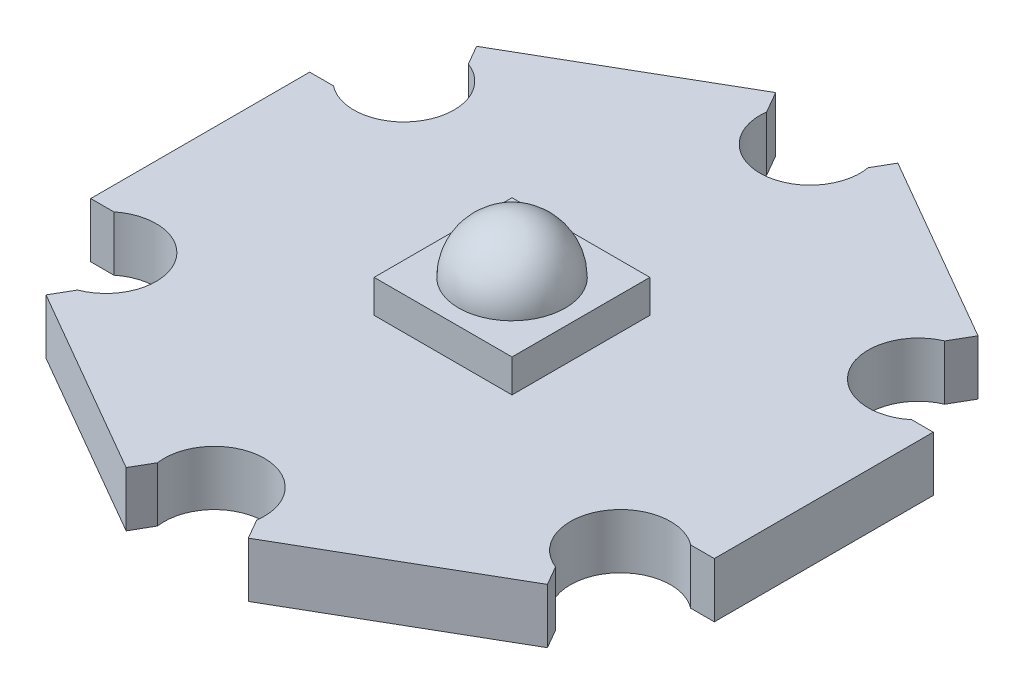
ISO-10303-21;
HEADER;
FILE_DESCRIPTION(('STEP AP214'),'2;1');
FILE_NAME('part.step','',(''),(''),'','','');
FILE_SCHEMA(('AUTOMOTIVE_DESIGN { 1 0 10303 214 1 1 1 1 }'));
ENDSEC;
DATA;
#1=APPLICATION_CONTEXT('core data for automotive mechanical design processes');
#2=APPLICATION_PROTOCOL_DEFINITION('international standard','automotive_design',2000,#1);
#3=PRODUCT_CONTEXT('',#1,'mechanical');
#4=PRODUCT('Part','Part','',(#3));
#5=PRODUCT_RELATED_PRODUCT_CATEGORY('part','',(#4));
#6=PRODUCT_DEFINITION_FORMATION('','',#4);
#7=PRODUCT_DEFINITION_CONTEXT('part definition',#1,'design');
#8=PRODUCT_DEFINITION('design','',#6,#7);
#9=PRODUCT_DEFINITION_SHAPE('','',#8);
#10=(LENGTH_UNIT() NAMED_UNIT(*) SI_UNIT(.MILLI.,.METRE.));
#11=(NAMED_UNIT(*) PLANE_ANGLE_UNIT() SI_UNIT($,.RADIAN.));
#12=(NAMED_UNIT(*) SI_UNIT($,.STERADIAN.) SOLID_ANGLE_UNIT());
#13=UNCERTAINTY_MEASURE_WITH_UNIT(LENGTH_MEASURE(1.E-05),#10,'distance_accuracy_value','');
#14=(GEOMETRIC_REPRESENTATION_CONTEXT(3) GLOBAL_UNCERTAINTY_ASSIGNED_CONTEXT((#13)) GLOBAL_UNIT_ASSIGNED_CONTEXT((#10,
#11,#12)) REPRESENTATION_CONTEXT('',''));
#15=CARTESIAN_POINT('',(0.,0.,0.));
#16=DIRECTION('',(0.,0.,1.));
#17=DIRECTION('',(1.,0.,0.));
#18=AXIS2_PLACEMENT_3D('',#15,#16,#17);
#19=CARTESIAN_POINT('',(0.,1.75,0.));
#20=DIRECTION('',(0.,1.,0.));
#21=DIRECTION('',(0.,0.,1.));
#22=AXIS2_PLACEMENT_3D('',#19,#20,#21);
#23=PLANE('',#22);
#24=CARTESIAN_POINT('',(-8.21347439932689,1.75,4.7420782115678));
#25=DIRECTION('',(0.,1.,0.));
#26=DIRECTION('',(0.,0.,1.));
#27=AXIS2_PLACEMENT_3D('',#24,#25,#26);
#28=CIRCLE('',#27,1.6);
#29=CARTESIAN_POINT('',(-7.63237899779938,1.75,6.23282572014314));
#30=VERTEX_POINT('',#29);
#31=CARTESIAN_POINT('',(-9.21390219566101,1.75,3.4934212433327));
#32=VERTEX_POINT('',#31);
#33=EDGE_CURVE('E258',#30,#32,#28,.T.);
#34=ORIENTED_EDGE('',*,*,#33,.F.);
#35=DIRECTION('',(-0.5,0.,0.866025403784439));
#36=VECTOR('',#35,1.);
#37=CARTESIAN_POINT('',(-3.02539154284704,1.75,-1.74671062166676));
#38=LINE('',#37,#36);
#39=CARTESIAN_POINT('',(-8.00039154284681,1.75,6.87024214598801));
#40=VERTEX_POINT('',#39);
#41=EDGE_CURVE('E297',#30,#40,#38,.T.);
#42=ORIENTED_EDGE('',*,*,#41,.T.);
#43=DIRECTION('',(0.866025403784439,0.,0.5));
#44=VECTOR('',#43,1.);
#45=CARTESIAN_POINT('',(-4.97499999999976,1.75,8.61695276765477));
#46=LINE('',#45,#44);
#47=CARTESIAN_POINT('',(-1.94960845715319,1.75,10.3636633893213));
#48=VERTEX_POINT('',#47);
#49=EDGE_CURVE('E292',#40,#48,#46,.T.);
#50=ORIENTED_EDGE('',*,*,#49,.T.);
#51=DIRECTION('',(0.499999999999999,0.,-0.866025403784439));
#52=VECTOR('',#51,1.);
#53=CARTESIAN_POINT('',(3.02539154284657,1.75,1.74671062166648));
#54=LINE('',#53,#52);
#55=CARTESIAN_POINT('',(-1.58345882645334,1.75,9.72947362577652));
#56=VERTEX_POINT('',#55);
#57=EDGE_CURVE('E305',#48,#56,#54,.T.);
#58=ORIENTED_EDGE('',*,*,#57,.T.);
#59=CARTESIAN_POINT('',(0.,1.75,9.5));
#60=DIRECTION('',(0.,1.,0.));
#61=DIRECTION('',(0.,0.,1.));
#62=AXIS2_PLACEMENT_3D('',#59,#60,#61);
#63=CIRCLE('',#62,1.6);
#64=CARTESIAN_POINT('',(1.58345882645334,1.75,9.72947362577651));
#65=VERTEX_POINT('',#64);
#66=EDGE_CURVE('E285',#65,#56,#63,.T.);
#67=ORIENTED_EDGE('',*,*,#66,.F.);
#68=DIRECTION('',(0.5,0.,0.866025403784439));
#69=VECTOR('',#68,1.);
#70=CARTESIAN_POINT('',(-3.02539154284657,1.75,1.74671062166649));
#71=LINE('',#70,#69);
#72=CARTESIAN_POINT('',(1.94960845715319,1.75,10.3636633893212));
#73=VERTEX_POINT('',#72);
#74=EDGE_CURVE('E339',#65,#73,#71,.T.);
#75=ORIENTED_EDGE('',*,*,#74,.T.);
#76=DIRECTION('',(0.866025403784439,0.,-0.5));
#77=VECTOR('',#76,1.);
#78=CARTESIAN_POINT('',(4.97499999999977,1.75,8.61695276765476));
#79=LINE('',#78,#77);
#80=CARTESIAN_POINT('',(8.00039154284681,1.75,6.870242145988));
#81=VERTEX_POINT('',#80);
#82=EDGE_CURVE('E333',#73,#81,#79,.T.);
#83=ORIENTED_EDGE('',*,*,#82,.T.);
#84=DIRECTION('',(-0.5,0.,-0.866025403784438));
#85=VECTOR('',#84,1.);
#86=CARTESIAN_POINT('',(3.02539154284704,1.75,-1.74671062166676));
#87=LINE('',#86,#85);
#88=CARTESIAN_POINT('',(7.64612293613772,1.75,6.25663091964122));
#89=VERTEX_POINT('',#88);
#90=EDGE_CURVE('E347',#81,#89,#87,.T.);
#91=ORIENTED_EDGE('',*,*,#90,.T.);
#92=CARTESIAN_POINT('',(8.22721833766523,1.75,4.76588341106587));
#93=DIRECTION('',(0.,1.,0.));
#94=DIRECTION('',(0.,0.,1.));
#95=AXIS2_PLACEMENT_3D('',#92,#93,#94);
#96=CIRCLE('',#95,1.6);
#97=CARTESIAN_POINT('',(9.19718742567154,1.75,3.4934212433327));
#98=VERTEX_POINT('',#97);
#99=EDGE_CURVE('E247',#98,#89,#96,.T.);
#100=ORIENTED_EDGE('',*,*,#99,.F.);
#101=DIRECTION('',(1.,0.,0.));
#102=VECTOR('',#101,1.);
#103=CARTESIAN_POINT('',(0.,1.75,3.4934212433327));
#104=LINE('',#103,#102);
#105=CARTESIAN_POINT('',(9.95,1.75,3.4934212433327));
#106=VERTEX_POINT('',#105);
#107=EDGE_CURVE('E318',#98,#106,#104,.T.);
#108=ORIENTED_EDGE('',*,*,#107,.T.);
#109=DIRECTION('',(0.,0.,-1.));
#110=VECTOR('',#109,1.);
#111=CARTESIAN_POINT('',(9.95,1.75,0.));
#112=LINE('',#111,#110);
#113=CARTESIAN_POINT('',(9.95,1.75,-3.49342124333378));
#114=VERTEX_POINT('',#113);
#115=EDGE_CURVE('E312',#106,#114,#112,.T.);
#116=ORIENTED_EDGE('',*,*,#115,.T.);
#117=DIRECTION('',(-1.,0.,0.));
#118=VECTOR('',#117,1.);
#119=CARTESIAN_POINT('',(0.,1.75,-3.49342124333378));
#120=LINE('',#119,#118);
#121=CARTESIAN_POINT('',(9.26094637796826,1.75,-3.49342124333378));
#122=VERTEX_POINT('',#121);
#123=EDGE_CURVE('E326',#114,#122,#120,.T.);
#124=ORIENTED_EDGE('',*,*,#123,.T.);
#125=CARTESIAN_POINT('',(8.24096227600355,1.75,-4.72615496630044));
#126=DIRECTION('',(0.,1.,0.));
#127=DIRECTION('',(0.,0.,1.));
#128=AXIS2_PLACEMENT_3D('',#125,#126,#127);
#129=CIRCLE('',#128,1.6);
#130=CARTESIAN_POINT('',(7.61186116589056,1.75,-6.197287792817));
#131=VERTEX_POINT('',#130);
#132=EDGE_CURVE('E272',#131,#122,#129,.T.);
#133=ORIENTED_EDGE('',*,*,#132,.F.);
#134=DIRECTION('',(0.499999999999999,0.,-0.866025403784439));
#135=VECTOR('',#134,1.);
#136=CARTESIAN_POINT('',(3.02539154284657,1.75,1.74671062166648));
#137=LINE('',#136,#135);
#138=CARTESIAN_POINT('',(8.0003915428468,1.75,-6.87024214598909));
#139=VERTEX_POINT('',#138);
#140=EDGE_CURVE('E354',#131,#139,#137,.T.);
#141=ORIENTED_EDGE('',*,*,#140,.T.);
#142=DIRECTION('',(0.866025403784439,0.,0.5));
#143=VECTOR('',#142,1.);
#144=CARTESIAN_POINT('',(4.97500000000023,1.75,-8.61695276765557));
#145=LINE('',#144,#143);
#146=CARTESIAN_POINT('',(1.94960845715319,1.75,-10.3636633893223));
#147=VERTEX_POINT('',#146);
#148=EDGE_CURVE('E367',#147,#139,#145,.T.);
#149=ORIENTED_EDGE('',*,*,#148,.F.);
#150=DIRECTION('',(-0.5,0.,0.866025403784439));
#151=VECTOR('',#150,1.);
#152=CARTESIAN_POINT('',(-3.02539154284704,1.75,-1.74671062166676));
#153=LINE('',#152,#151);
#154=CARTESIAN_POINT('',(1.60294774285476,1.75,-9.76322941916932));
#155=VERTEX_POINT('',#154);
#156=EDGE_CURVE('E359',#147,#155,#153,.T.);
#157=ORIENTED_EDGE('',*,*,#156,.T.);
#158=CARTESIAN_POINT('',(0.0274878766766615,1.75,-9.48407675473264));
#159=DIRECTION('',(0.,1.,0.));
#160=DIRECTION('',(0.,0.,1.));
#161=AXIS2_PLACEMENT_3D('',#158,#159,#160);
#162=CIRCLE('',#161,1.6);
#163=CARTESIAN_POINT('',(-1.55947285981209,1.75,-9.68792871288629));
#164=VERTEX_POINT('',#163);
#165=EDGE_CURVE('E267',#164,#155,#162,.T.);
#166=ORIENTED_EDGE('',*,*,#165,.F.);
#167=DIRECTION('',(-0.5,0.,-0.866025403784438));
#168=VECTOR('',#167,1.);
#169=CARTESIAN_POINT('',(3.02539154284704,1.75,-1.74671062166676));
#170=LINE('',#169,#168);
#171=CARTESIAN_POINT('',(-1.9496084571532,1.75,-10.3636633893223));
#172=VERTEX_POINT('',#171);
#173=EDGE_CURVE('E374',#164,#172,#170,.T.);
#174=ORIENTED_EDGE('',*,*,#173,.T.);
#175=DIRECTION('',(0.866025403784439,0.,-0.5));
#176=VECTOR('',#175,1.);
#177=CARTESIAN_POINT('',(-4.97500000000023,1.75,-8.61695276765557));
#178=LINE('',#177,#176);
#179=CARTESIAN_POINT('',(-8.0003915428468,1.75,-6.87024214598908));
#180=VERTEX_POINT('',#179);
#181=EDGE_CURVE('E388',#180,#172,#178,.T.);
#182=ORIENTED_EDGE('',*,*,#181,.F.);
#183=DIRECTION('',(0.5,0.,0.866025403784439));
#184=VECTOR('',#183,1.);
#185=CARTESIAN_POINT('',(-3.02539154284657,1.75,1.74671062166649));
#186=LINE('',#185,#184);
#187=CARTESIAN_POINT('',(-7.64208522195565,1.75,-6.24963739353252));
#188=VERTEX_POINT('',#187);
#189=EDGE_CURVE('E380',#180,#188,#186,.T.);
#190=ORIENTED_EDGE('',*,*,#189,.T.);
#191=CARTESIAN_POINT('',(-8.19973046098856,1.75,-4.74996016579852));
#192=DIRECTION('',(0.,1.,0.));
#193=DIRECTION('',(0.,0.,1.));
#194=AXIS2_PLACEMENT_3D('',#191,#192,#193);
#195=CIRCLE('',#194,1.6);
#196=CARTESIAN_POINT('',(-9.19024039851122,1.75,-3.49342124333378));
#197=VERTEX_POINT('',#196);
#198=EDGE_CURVE('E60',#197,#188,#195,.T.);
#199=ORIENTED_EDGE('',*,*,#198,.F.);
#200=DIRECTION('',(-1.,0.,0.));
#201=VECTOR('',#200,1.);
#202=CARTESIAN_POINT('',(0.,1.75,-3.49342124333378));
#203=LINE('',#202,#201);
#204=CARTESIAN_POINT('',(-9.95,1.75,-3.49342124333378));
#205=VERTEX_POINT('',#204);
#206=EDGE_CURVE('E395',#197,#205,#203,.T.);
#207=ORIENTED_EDGE('',*,*,#206,.T.);
#208=DIRECTION('',(0.,0.,-1.));
#209=VECTOR('',#208,1.);
#210=CARTESIAN_POINT('',(-9.95,1.75,0.));
#211=LINE('',#210,#209);
#212=CARTESIAN_POINT('',(-9.95,1.75,3.4934212433327));
#213=VERTEX_POINT('',#212);
#214=EDGE_CURVE('E409',#213,#205,#211,.T.);
#215=ORIENTED_EDGE('',*,*,#214,.F.);
#216=DIRECTION('',(1.,0.,0.));
#217=VECTOR('',#216,1.);
#218=CARTESIAN_POINT('',(0.,1.75,3.4934212433327));
#219=LINE('',#218,#217);
#220=EDGE_CURVE('E401',#213,#32,#219,.T.);
#221=ORIENTED_EDGE('',*,*,#220,.T.);
#222=EDGE_LOOP('',(#34,#42,#50,#58,#67,#75,#83,#91,#100,#108,#116,#124,#133,#141,#149,#157,#166,
#174,#182,#190,#199,#207,#215,#221));
#223=FACE_BOUND('',#222,.T.);
#224=DIRECTION('',(1.,0.,0.));
#225=VECTOR('',#224,1.);
#226=CARTESIAN_POINT('',(-2.2,1.75,2.2));
#227=LINE('',#226,#225);
#228=CARTESIAN_POINT('',(-2.2,1.75,2.2));
#229=VERTEX_POINT('',#228);
#230=CARTESIAN_POINT('',(2.2,1.75,2.2));
#231=VERTEX_POINT('',#230);
#232=EDGE_CURVE('E803',#229,#231,#227,.T.);
#233=ORIENTED_EDGE('',*,*,#232,.F.);
#234=DIRECTION('',(0.,0.,1.));
#235=VECTOR('',#234,1.);
#236=CARTESIAN_POINT('',(-2.2,1.75,-2.2));
#237=LINE('',#236,#235);
#238=CARTESIAN_POINT('',(-2.2,1.75,-2.2));
#239=VERTEX_POINT('',#238);
#240=EDGE_CURVE('E245',#239,#229,#237,.T.);
#241=ORIENTED_EDGE('',*,*,#240,.F.);
#242=DIRECTION('',(-1.,0.,0.));
#243=VECTOR('',#242,1.);
#244=CARTESIAN_POINT('',(-2.2,1.75,-2.2));
#245=LINE('',#244,#243);
#246=CARTESIAN_POINT('',(2.2,1.75,-2.2));
#247=VERTEX_POINT('',#246);
#248=EDGE_CURVE('E241',#247,#239,#245,.T.);
#249=ORIENTED_EDGE('',*,*,#248,.F.);
#250=DIRECTION('',(0.,0.,-1.));
#251=VECTOR('',#250,1.);
#252=CARTESIAN_POINT('',(2.2,1.75,-2.2));
#253=LINE('',#252,#251);
#254=EDGE_CURVE('E810',#231,#247,#253,.T.);
#255=ORIENTED_EDGE('',*,*,#254,.F.);
#256=EDGE_LOOP('',(#233,#241,#249,#255));
#257=FACE_BOUND('',#256,.T.);
#258=ADVANCED_FACE('F38',(#223,#257),#23,.T.);
#259=CARTESIAN_POINT('',(0.,0.,0.));
#260=DIRECTION('',(0.,1.,0.));
#261=DIRECTION('',(0.,0.,1.));
#262=AXIS2_PLACEMENT_3D('',#259,#260,#261);
#263=PLANE('',#262);
#264=DIRECTION('',(-0.5,0.,0.866025403784439));
#265=VECTOR('',#264,1.);
#266=CARTESIAN_POINT('',(-3.02539154284704,0.,-1.74671062166676));
#267=LINE('',#266,#265);
#268=CARTESIAN_POINT('',(-7.63237899779939,0.,6.23282572014314));
#269=VERTEX_POINT('',#268);
#270=CARTESIAN_POINT('',(-8.00039154284681,0.,6.87024214598801));
#271=VERTEX_POINT('',#270);
#272=EDGE_CURVE('E300',#269,#271,#267,.T.);
#273=ORIENTED_EDGE('',*,*,#272,.F.);
#274=CARTESIAN_POINT('',(-8.21347439932689,0.,4.7420782115678));
#275=DIRECTION('',(0.,1.,0.));
#276=DIRECTION('',(0.,0.,1.));
#277=AXIS2_PLACEMENT_3D('',#274,#275,#276);
#278=CIRCLE('',#277,1.6);
#279=CARTESIAN_POINT('',(-9.21390219566101,0.,3.4934212433327));
#280=VERTEX_POINT('',#279);
#281=EDGE_CURVE('E254',#269,#280,#278,.T.);
#282=ORIENTED_EDGE('',*,*,#281,.T.);
#283=DIRECTION('',(1.,0.,0.));
#284=VECTOR('',#283,1.);
#285=CARTESIAN_POINT('',(0.,0.,3.4934212433327));
#286=LINE('',#285,#284);
#287=CARTESIAN_POINT('',(-9.95,0.,3.4934212433327));
#288=VERTEX_POINT('',#287);
#289=EDGE_CURVE('E404',#288,#280,#286,.T.);
#290=ORIENTED_EDGE('',*,*,#289,.F.);
#291=DIRECTION('',(0.,0.,-1.));
#292=VECTOR('',#291,1.);
#293=CARTESIAN_POINT('',(-9.95,0.,0.));
#294=LINE('',#293,#292);
#295=CARTESIAN_POINT('',(-9.95,0.,-3.49342124333378));
#296=VERTEX_POINT('',#295);
#297=EDGE_CURVE('E400',#288,#296,#294,.T.);
#298=ORIENTED_EDGE('',*,*,#297,.T.);
#299=DIRECTION('',(-1.,0.,0.));
#300=VECTOR('',#299,1.);
#301=CARTESIAN_POINT('',(0.,0.,-3.49342124333378));
#302=LINE('',#301,#300);
#303=CARTESIAN_POINT('',(-9.19024039851122,0.,-3.49342124333378));
#304=VERTEX_POINT('',#303);
#305=EDGE_CURVE('E398',#304,#296,#302,.T.);
#306=ORIENTED_EDGE('',*,*,#305,.F.);
#307=CARTESIAN_POINT('',(-8.19973046098856,0.,-4.74996016579852));
#308=DIRECTION('',(0.,1.,0.));
#309=DIRECTION('',(0.,0.,1.));
#310=AXIS2_PLACEMENT_3D('',#307,#308,#309);
#311=CIRCLE('',#310,1.6);
#312=CARTESIAN_POINT('',(-7.64208522195565,0.,-6.24963739353252));
#313=VERTEX_POINT('',#312);
#314=EDGE_CURVE('E260',#304,#313,#311,.T.);
#315=ORIENTED_EDGE('',*,*,#314,.T.);
#316=DIRECTION('',(0.5,0.,0.866025403784439));
#317=VECTOR('',#316,1.);
#318=CARTESIAN_POINT('',(-3.02539154284657,0.,1.74671062166649));
#319=LINE('',#318,#317);
#320=CARTESIAN_POINT('',(-8.0003915428468,0.,-6.87024214598908));
#321=VERTEX_POINT('',#320);
#322=EDGE_CURVE('E383',#321,#313,#319,.T.);
#323=ORIENTED_EDGE('',*,*,#322,.F.);
#324=DIRECTION('',(0.866025403784439,0.,-0.5));
#325=VECTOR('',#324,1.);
#326=CARTESIAN_POINT('',(-4.97500000000023,0.,-8.61695276765557));
#327=LINE('',#326,#325);
#328=CARTESIAN_POINT('',(-1.9496084571532,0.,-10.3636633893223));
#329=VERTEX_POINT('',#328);
#330=EDGE_CURVE('E379',#321,#329,#327,.T.);
#331=ORIENTED_EDGE('',*,*,#330,.T.);
#332=DIRECTION('',(-0.5,0.,-0.866025403784438));
#333=VECTOR('',#332,1.);
#334=CARTESIAN_POINT('',(3.02539154284704,0.,-1.74671062166676));
#335=LINE('',#334,#333);
#336=CARTESIAN_POINT('',(-1.55947285981209,0.,-9.68792871288629));
#337=VERTEX_POINT('',#336);
#338=EDGE_CURVE('E377',#337,#329,#335,.T.);
#339=ORIENTED_EDGE('',*,*,#338,.F.);
#340=CARTESIAN_POINT('',(0.0274878766766615,0.,-9.48407675473264));
#341=DIRECTION('',(0.,1.,0.));
#342=DIRECTION('',(0.,0.,1.));
#343=AXIS2_PLACEMENT_3D('',#340,#341,#342);
#344=CIRCLE('',#343,1.6);
#345=CARTESIAN_POINT('',(1.60294774285476,0.,-9.76322941916932));
#346=VERTEX_POINT('',#345);
#347=EDGE_CURVE('E264',#337,#346,#344,.T.);
#348=ORIENTED_EDGE('',*,*,#347,.T.);
#349=DIRECTION('',(-0.5,0.,0.866025403784439));
#350=VECTOR('',#349,1.);
#351=CARTESIAN_POINT('',(-3.02539154284704,0.,-1.74671062166676));
#352=LINE('',#351,#350);
#353=CARTESIAN_POINT('',(1.94960845715319,0.,-10.3636633893223));
#354=VERTEX_POINT('',#353);
#355=EDGE_CURVE('E362',#354,#346,#352,.T.);
#356=ORIENTED_EDGE('',*,*,#355,.F.);
#357=DIRECTION('',(0.866025403784439,0.,0.5));
#358=VECTOR('',#357,1.);
#359=CARTESIAN_POINT('',(4.97500000000023,0.,-8.61695276765557));
#360=LINE('',#359,#358);
#361=CARTESIAN_POINT('',(8.0003915428468,0.,-6.87024214598909));
#362=VERTEX_POINT('',#361);
#363=EDGE_CURVE('E358',#354,#362,#360,.T.);
#364=ORIENTED_EDGE('',*,*,#363,.T.);
#365=DIRECTION('',(0.499999999999999,0.,-0.866025403784439));
#366=VECTOR('',#365,1.);
#367=CARTESIAN_POINT('',(3.02539154284657,0.,1.74671062166648));
#368=LINE('',#367,#366);
#369=CARTESIAN_POINT('',(7.61186116589056,0.,-6.197287792817));
#370=VERTEX_POINT('',#369);
#371=EDGE_CURVE('E356',#370,#362,#368,.T.);
#372=ORIENTED_EDGE('',*,*,#371,.F.);
#373=CARTESIAN_POINT('',(8.24096227600355,0.,-4.72615496630044));
#374=DIRECTION('',(0.,1.,0.));
#375=DIRECTION('',(0.,0.,1.));
#376=AXIS2_PLACEMENT_3D('',#373,#374,#375);
#377=CIRCLE('',#376,1.6);
#378=CARTESIAN_POINT('',(9.26094637796826,0.,-3.49342124333378));
#379=VERTEX_POINT('',#378);
#380=EDGE_CURVE('E269',#370,#379,#377,.T.);
#381=ORIENTED_EDGE('',*,*,#380,.T.);
#382=DIRECTION('',(-1.,0.,0.));
#383=VECTOR('',#382,1.);
#384=CARTESIAN_POINT('',(0.,0.,-3.49342124333378));
#385=LINE('',#384,#383);
#386=CARTESIAN_POINT('',(9.95,0.,-3.49342124333378));
#387=VERTEX_POINT('',#386);
#388=EDGE_CURVE('E317',#387,#379,#385,.T.);
#389=ORIENTED_EDGE('',*,*,#388,.F.);
#390=DIRECTION('',(0.,0.,-1.));
#391=VECTOR('',#390,1.);
#392=CARTESIAN_POINT('',(9.95,0.,0.));
#393=LINE('',#392,#391);
#394=CARTESIAN_POINT('',(9.95,0.,3.4934212433327));
#395=VERTEX_POINT('',#394);
#396=EDGE_CURVE('E314',#395,#387,#393,.T.);
#397=ORIENTED_EDGE('',*,*,#396,.F.);
#398=DIRECTION('',(1.,0.,0.));
#399=VECTOR('',#398,1.);
#400=CARTESIAN_POINT('',(0.,0.,3.4934212433327));
#401=LINE('',#400,#399);
#402=CARTESIAN_POINT('',(9.19718742567154,0.,3.4934212433327));
#403=VERTEX_POINT('',#402);
#404=EDGE_CURVE('E321',#403,#395,#401,.T.);
#405=ORIENTED_EDGE('',*,*,#404,.F.);
#406=CARTESIAN_POINT('',(8.22721833766523,0.,4.76588341106587));
#407=DIRECTION('',(0.,1.,0.));
#408=DIRECTION('',(0.,0.,1.));
#409=AXIS2_PLACEMENT_3D('',#406,#407,#408);
#410=CIRCLE('',#409,1.6);
#411=CARTESIAN_POINT('',(7.64612293613772,0.,6.25663091964122));
#412=VERTEX_POINT('',#411);
#413=EDGE_CURVE('E249',#403,#412,#410,.T.);
#414=ORIENTED_EDGE('',*,*,#413,.T.);
#415=DIRECTION('',(-0.5,0.,-0.866025403784438));
#416=VECTOR('',#415,1.);
#417=CARTESIAN_POINT('',(3.02539154284704,0.,-1.74671062166676));
#418=LINE('',#417,#416);
#419=CARTESIAN_POINT('',(8.00039154284681,0.,6.870242145988));
#420=VERTEX_POINT('',#419);
#421=EDGE_CURVE('E338',#420,#412,#418,.T.);
#422=ORIENTED_EDGE('',*,*,#421,.F.);
#423=DIRECTION('',(0.866025403784439,0.,-0.5));
#424=VECTOR('',#423,1.);
#425=CARTESIAN_POINT('',(4.97499999999977,0.,8.61695276765476));
#426=LINE('',#425,#424);
#427=CARTESIAN_POINT('',(1.94960845715319,0.,10.3636633893212));
#428=VERTEX_POINT('',#427);
#429=EDGE_CURVE('E335',#428,#420,#426,.T.);
#430=ORIENTED_EDGE('',*,*,#429,.F.);
#431=DIRECTION('',(0.5,0.,0.866025403784439));
#432=VECTOR('',#431,1.);
#433=CARTESIAN_POINT('',(-3.02539154284657,0.,1.74671062166649));
#434=LINE('',#433,#432);
#435=CARTESIAN_POINT('',(1.58345882645334,0.,9.72947362577651));
#436=VERTEX_POINT('',#435);
#437=EDGE_CURVE('E342',#436,#428,#434,.T.);
#438=ORIENTED_EDGE('',*,*,#437,.F.);
#439=CARTESIAN_POINT('',(0.,0.,9.5));
#440=DIRECTION('',(0.,1.,0.));
#441=DIRECTION('',(0.,0.,1.));
#442=AXIS2_PLACEMENT_3D('',#439,#440,#441);
#443=CIRCLE('',#442,1.6);
#444=CARTESIAN_POINT('',(-1.58345882645334,0.,9.72947362577652));
#445=VERTEX_POINT('',#444);
#446=EDGE_CURVE('E286',#436,#445,#443,.T.);
#447=ORIENTED_EDGE('',*,*,#446,.T.);
#448=DIRECTION('',(0.499999999999999,0.,-0.866025403784439));
#449=VECTOR('',#448,1.);
#450=CARTESIAN_POINT('',(3.02539154284657,0.,1.74671062166648));
#451=LINE('',#450,#449);
#452=CARTESIAN_POINT('',(-1.94960845715319,0.,10.3636633893213));
#453=VERTEX_POINT('',#452);
#454=EDGE_CURVE('E296',#453,#445,#451,.T.);
#455=ORIENTED_EDGE('',*,*,#454,.F.);
#456=DIRECTION('',(0.866025403784439,0.,0.5));
#457=VECTOR('',#456,1.);
#458=CARTESIAN_POINT('',(-4.97499999999976,0.,8.61695276765477));
#459=LINE('',#458,#457);
#460=EDGE_CURVE('E293',#271,#453,#459,.T.);
#461=ORIENTED_EDGE('',*,*,#460,.F.);
#462=EDGE_LOOP('',(#273,#282,#290,#298,#306,#315,#323,#331,#339,#348,#356,#364,#372,#381,#389,
#397,#405,#414,#422,#430,#438,#447,#455,#461));
#463=FACE_BOUND('',#462,.T.);
#464=ADVANCED_FACE('F436',(#463),#263,.F.);
#465=CARTESIAN_POINT('',(0.,0.,3.4934212433327));
#466=DIRECTION('',(0.,0.,1.));
#467=DIRECTION('',(1.,0.,0.));
#468=AXIS2_PLACEMENT_3D('',#465,#466,#467);
#469=PLANE('',#468);
#470=DIRECTION('',(0.,1.,0.));
#471=VECTOR('',#470,1.);
#472=CARTESIAN_POINT('',(-9.21390219566101,0.,3.4934212433327));
#473=LINE('',#472,#471);
#474=EDGE_CURVE('E257',#32,#280,#473,.F.);
#475=ORIENTED_EDGE('',*,*,#474,.F.);
#476=ORIENTED_EDGE('',*,*,#220,.F.);
#477=DIRECTION('',(0.,1.,0.));
#478=VECTOR('',#477,1.);
#479=CARTESIAN_POINT('',(-9.95,0.,3.4934212433327));
#480=LINE('',#479,#478);
#481=EDGE_CURVE('E414',#288,#213,#480,.T.);
#482=ORIENTED_EDGE('',*,*,#481,.F.);
#483=ORIENTED_EDGE('',*,*,#289,.T.);
#484=EDGE_LOOP('',(#475,#476,#482,#483));
#485=FACE_BOUND('',#484,.T.);
#486=ADVANCED_FACE('F506',(#485),#469,.T.);
#487=CARTESIAN_POINT('',(-9.95,0.,0.));
#488=DIRECTION('',(1.,0.,0.));
#489=DIRECTION('',(0.,0.,-1.));
#490=AXIS2_PLACEMENT_3D('',#487,#488,#489);
#491=PLANE('',#490);
#492=ORIENTED_EDGE('',*,*,#214,.T.);
#493=DIRECTION('',(0.,1.,0.));
#494=VECTOR('',#493,1.);
#495=CARTESIAN_POINT('',(-9.95,0.,-3.49342124333378));
#496=LINE('',#495,#494);
#497=EDGE_CURVE('E407',#296,#205,#496,.T.);
#498=ORIENTED_EDGE('',*,*,#497,.F.);
#499=ORIENTED_EDGE('',*,*,#297,.F.);
#500=ORIENTED_EDGE('',*,*,#481,.T.);
#501=EDGE_LOOP('',(#492,#498,#499,#500));
#502=FACE_BOUND('',#501,.T.);
#503=ADVANCED_FACE('F512',(#502),#491,.F.);
#504=CARTESIAN_POINT('',(0.,0.,-3.49342124333378));
#505=DIRECTION('',(0.,0.,-1.));
#506=DIRECTION('',(-1.,0.,0.));
#507=AXIS2_PLACEMENT_3D('',#504,#505,#506);
#508=PLANE('',#507);
#509=DIRECTION('',(0.,1.,0.));
#510=VECTOR('',#509,1.);
#511=CARTESIAN_POINT('',(-9.19024039851122,0.,-3.49342124333378));
#512=LINE('',#511,#510);
#513=EDGE_CURVE('E283',#304,#197,#512,.T.);
#514=ORIENTED_EDGE('',*,*,#513,.F.);
#515=ORIENTED_EDGE('',*,*,#305,.T.);
#516=ORIENTED_EDGE('',*,*,#497,.T.);
#517=ORIENTED_EDGE('',*,*,#206,.F.);
#518=EDGE_LOOP('',(#514,#515,#516,#517));
#519=FACE_BOUND('',#518,.T.);
#520=ADVANCED_FACE('F517',(#519),#508,.T.);
#521=CARTESIAN_POINT('',(-3.02539154284657,0.,1.74671062166649));
#522=DIRECTION('',(-0.866025403784439,0.,0.5));
#523=DIRECTION('',(0.5,0.,0.866025403784439));
#524=AXIS2_PLACEMENT_3D('',#521,#522,#523);
#525=PLANE('',#524);
#526=DIRECTION('',(0.,1.,0.));
#527=VECTOR('',#526,1.);
#528=CARTESIAN_POINT('',(-7.64208522195565,0.,-6.24963739353252));
#529=LINE('',#528,#527);
#530=EDGE_CURVE('E12',#188,#313,#529,.F.);
#531=ORIENTED_EDGE('',*,*,#530,.F.);
#532=ORIENTED_EDGE('',*,*,#189,.F.);
#533=DIRECTION('',(0.,1.,0.));
#534=VECTOR('',#533,1.);
#535=CARTESIAN_POINT('',(-8.0003915428468,0.,-6.87024214598908));
#536=LINE('',#535,#534);
#537=EDGE_CURVE('E393',#321,#180,#536,.T.);
#538=ORIENTED_EDGE('',*,*,#537,.F.);
#539=ORIENTED_EDGE('',*,*,#322,.T.);
#540=EDGE_LOOP('',(#531,#532,#538,#539));
#541=FACE_BOUND('',#540,.T.);
#542=ADVANCED_FACE('F523',(#541),#525,.T.);
#543=CARTESIAN_POINT('',(-4.97500000000023,0.,-8.61695276765557));
#544=DIRECTION('',(0.5,0.,0.866025403784439));
#545=DIRECTION('',(0.866025403784439,0.,-0.5));
#546=AXIS2_PLACEMENT_3D('',#543,#544,#545);
#547=PLANE('',#546);
#548=ORIENTED_EDGE('',*,*,#181,.T.);
#549=DIRECTION('',(0.,1.,0.));
#550=VECTOR('',#549,1.);
#551=CARTESIAN_POINT('',(-1.9496084571532,0.,-10.3636633893223));
#552=LINE('',#551,#550);
#553=EDGE_CURVE('E386',#329,#172,#552,.T.);
#554=ORIENTED_EDGE('',*,*,#553,.F.);
#555=ORIENTED_EDGE('',*,*,#330,.F.);
#556=ORIENTED_EDGE('',*,*,#537,.T.);
#557=EDGE_LOOP('',(#548,#554,#555,#556));
#558=FACE_BOUND('',#557,.T.);
#559=ADVANCED_FACE('F527',(#558),#547,.F.);
#560=CARTESIAN_POINT('',(3.02539154284704,0.,-1.74671062166676));
#561=DIRECTION('',(0.866025403784438,0.,-0.5));
#562=DIRECTION('',(-0.5,0.,-0.866025403784438));
#563=AXIS2_PLACEMENT_3D('',#560,#561,#562);
#564=PLANE('',#563);
#565=DIRECTION('',(0.,1.,0.));
#566=VECTOR('',#565,1.);
#567=CARTESIAN_POINT('',(-1.55947285981209,0.,-9.68792871288629));
#568=LINE('',#567,#566);
#569=EDGE_CURVE('E281',#337,#164,#568,.T.);
#570=ORIENTED_EDGE('',*,*,#569,.F.);
#571=ORIENTED_EDGE('',*,*,#338,.T.);
#572=ORIENTED_EDGE('',*,*,#553,.T.);
#573=ORIENTED_EDGE('',*,*,#173,.F.);
#574=EDGE_LOOP('',(#570,#571,#572,#573));
#575=FACE_BOUND('',#574,.T.);
#576=ADVANCED_FACE('F530',(#575),#564,.T.);
#577=CARTESIAN_POINT('',(-3.02539154284704,0.,-1.74671062166676));
#578=DIRECTION('',(-0.866025403784439,0.,-0.5));
#579=DIRECTION('',(-0.5,0.,0.866025403784439));
#580=AXIS2_PLACEMENT_3D('',#577,#578,#579);
#581=PLANE('',#580);
#582=DIRECTION('',(0.,1.,0.));
#583=VECTOR('',#582,1.);
#584=CARTESIAN_POINT('',(1.60294774285476,0.,-9.76322941916932));
#585=LINE('',#584,#583);
#586=EDGE_CURVE('E46',#155,#346,#585,.F.);
#587=ORIENTED_EDGE('',*,*,#586,.F.);
#588=ORIENTED_EDGE('',*,*,#156,.F.);
#589=DIRECTION('',(0.,1.,0.));
#590=VECTOR('',#589,1.);
#591=CARTESIAN_POINT('',(1.94960845715319,0.,-10.3636633893223));
#592=LINE('',#591,#590);
#593=EDGE_CURVE('E372',#354,#147,#592,.T.);
#594=ORIENTED_EDGE('',*,*,#593,.F.);
#595=ORIENTED_EDGE('',*,*,#355,.T.);
#596=EDGE_LOOP('',(#587,#588,#594,#595));
#597=FACE_BOUND('',#596,.T.);
#598=ADVANCED_FACE('F437',(#597),#581,.T.);
#599=CARTESIAN_POINT('',(4.97500000000023,0.,-8.61695276765557));
#600=DIRECTION('',(-0.5,0.,0.866025403784439));
#601=DIRECTION('',(0.866025403784439,0.,0.5));
#602=AXIS2_PLACEMENT_3D('',#599,#600,#601);
#603=PLANE('',#602);
#604=ORIENTED_EDGE('',*,*,#148,.T.);
#605=DIRECTION('',(0.,1.,0.));
#606=VECTOR('',#605,1.);
#607=CARTESIAN_POINT('',(8.0003915428468,0.,-6.87024214598909));
#608=LINE('',#607,#606);
#609=EDGE_CURVE('E365',#362,#139,#608,.T.);
#610=ORIENTED_EDGE('',*,*,#609,.F.);
#611=ORIENTED_EDGE('',*,*,#363,.F.);
#612=ORIENTED_EDGE('',*,*,#593,.T.);
#613=EDGE_LOOP('',(#604,#610,#611,#612));
#614=FACE_BOUND('',#613,.T.);
#615=ADVANCED_FACE('F442',(#614),#603,.F.);
#616=CARTESIAN_POINT('',(3.02539154284657,0.,1.74671062166648));
#617=DIRECTION('',(0.866025403784439,0.,0.499999999999999));
#618=DIRECTION('',(0.499999999999999,0.,-0.866025403784439));
#619=AXIS2_PLACEMENT_3D('',#616,#617,#618);
#620=PLANE('',#619);
#621=DIRECTION('',(0.,1.,0.));
#622=VECTOR('',#621,1.);
#623=CARTESIAN_POINT('',(7.61186116589056,0.,-6.197287792817));
#624=LINE('',#623,#622);
#625=EDGE_CURVE('E277',#370,#131,#624,.T.);
#626=ORIENTED_EDGE('',*,*,#625,.F.);
#627=ORIENTED_EDGE('',*,*,#371,.T.);
#628=ORIENTED_EDGE('',*,*,#609,.T.);
#629=ORIENTED_EDGE('',*,*,#140,.F.);
#630=EDGE_LOOP('',(#626,#627,#628,#629));
#631=FACE_BOUND('',#630,.T.);
#632=ADVANCED_FACE('F447',(#631),#620,.T.);
#633=CARTESIAN_POINT('',(4.97499999999977,0.,8.61695276765476));
#634=DIRECTION('',(0.5,0.,0.866025403784439));
#635=DIRECTION('',(0.866025403784439,0.,-0.5));
#636=AXIS2_PLACEMENT_3D('',#633,#634,#635);
#637=PLANE('',#636);
#638=ORIENTED_EDGE('',*,*,#82,.F.);
#639=DIRECTION('',(0.,1.,0.));
#640=VECTOR('',#639,1.);
#641=CARTESIAN_POINT('',(1.94960845715319,0.,10.3636633893212));
#642=LINE('',#641,#640);
#643=EDGE_CURVE('E351',#428,#73,#642,.T.);
#644=ORIENTED_EDGE('',*,*,#643,.F.);
#645=ORIENTED_EDGE('',*,*,#429,.T.);
#646=DIRECTION('',(0.,1.,0.));
#647=VECTOR('',#646,1.);
#648=CARTESIAN_POINT('',(8.00039154284681,0.,6.870242145988));
#649=LINE('',#648,#647);
#650=EDGE_CURVE('E344',#420,#81,#649,.T.);
#651=ORIENTED_EDGE('',*,*,#650,.T.);
#652=EDGE_LOOP('',(#638,#644,#645,#651));
#653=FACE_BOUND('',#652,.T.);
#654=ADVANCED_FACE('F478',(#653),#637,.T.);
#655=CARTESIAN_POINT('',(-3.02539154284657,0.,1.74671062166649));
#656=DIRECTION('',(-0.866025403784439,0.,0.5));
#657=DIRECTION('',(0.5,0.,0.866025403784439));
#658=AXIS2_PLACEMENT_3D('',#655,#656,#657);
#659=PLANE('',#658);
#660=DIRECTION('',(0.,1.,0.));
#661=VECTOR('',#660,1.);
#662=CARTESIAN_POINT('',(1.58345882645334,0.,9.72947362577651));
#663=LINE('',#662,#661);
#664=EDGE_CURVE('E289',#436,#65,#663,.T.);
#665=ORIENTED_EDGE('',*,*,#664,.F.);
#666=ORIENTED_EDGE('',*,*,#437,.T.);
#667=ORIENTED_EDGE('',*,*,#643,.T.);
#668=ORIENTED_EDGE('',*,*,#74,.F.);
#669=EDGE_LOOP('',(#665,#666,#667,#668));
#670=FACE_BOUND('',#669,.T.);
#671=ADVANCED_FACE('F484',(#670),#659,.T.);
#672=CARTESIAN_POINT('',(3.02539154284704,0.,-1.74671062166676));
#673=DIRECTION('',(0.866025403784438,0.,-0.5));
#674=DIRECTION('',(-0.5,0.,-0.866025403784438));
#675=AXIS2_PLACEMENT_3D('',#672,#673,#674);
#676=PLANE('',#675);
#677=DIRECTION('',(0.,1.,0.));
#678=VECTOR('',#677,1.);
#679=CARTESIAN_POINT('',(7.64612293613772,0.,6.25663091964122));
#680=LINE('',#679,#678);
#681=EDGE_CURVE('E279',#89,#412,#680,.F.);
#682=ORIENTED_EDGE('',*,*,#681,.F.);
#683=ORIENTED_EDGE('',*,*,#90,.F.);
#684=ORIENTED_EDGE('',*,*,#650,.F.);
#685=ORIENTED_EDGE('',*,*,#421,.T.);
#686=EDGE_LOOP('',(#682,#683,#684,#685));
#687=FACE_BOUND('',#686,.T.);
#688=ADVANCED_FACE('F474',(#687),#676,.T.);
#689=CARTESIAN_POINT('',(9.95,0.,0.));
#690=DIRECTION('',(1.,0.,0.));
#691=DIRECTION('',(0.,0.,-1.));
#692=AXIS2_PLACEMENT_3D('',#689,#690,#691);
#693=PLANE('',#692);
#694=ORIENTED_EDGE('',*,*,#115,.F.);
#695=DIRECTION('',(0.,1.,0.));
#696=VECTOR('',#695,1.);
#697=CARTESIAN_POINT('',(9.95,0.,3.4934212433327));
#698=LINE('',#697,#696);
#699=EDGE_CURVE('E330',#395,#106,#698,.T.);
#700=ORIENTED_EDGE('',*,*,#699,.F.);
#701=ORIENTED_EDGE('',*,*,#396,.T.);
#702=DIRECTION('',(0.,1.,0.));
#703=VECTOR('',#702,1.);
#704=CARTESIAN_POINT('',(9.95,0.,-3.49342124333378));
#705=LINE('',#704,#703);
#706=EDGE_CURVE('E323',#387,#114,#705,.T.);
#707=ORIENTED_EDGE('',*,*,#706,.T.);
#708=EDGE_LOOP('',(#694,#700,#701,#707));
#709=FACE_BOUND('',#708,.T.);
#710=ADVANCED_FACE('F464',(#709),#693,.T.);
#711=CARTESIAN_POINT('',(0.,0.,3.4934212433327));
#712=DIRECTION('',(0.,0.,1.));
#713=DIRECTION('',(1.,0.,0.));
#714=AXIS2_PLACEMENT_3D('',#711,#712,#713);
#715=PLANE('',#714);
#716=DIRECTION('',(0.,1.,0.));
#717=VECTOR('',#716,1.);
#718=CARTESIAN_POINT('',(9.19718742567154,0.,3.4934212433327));
#719=LINE('',#718,#717);
#720=EDGE_CURVE('E424',#403,#98,#719,.T.);
#721=ORIENTED_EDGE('',*,*,#720,.F.);
#722=ORIENTED_EDGE('',*,*,#404,.T.);
#723=ORIENTED_EDGE('',*,*,#699,.T.);
#724=ORIENTED_EDGE('',*,*,#107,.F.);
#725=EDGE_LOOP('',(#721,#722,#723,#724));
#726=FACE_BOUND('',#725,.T.);
#727=ADVANCED_FACE('F468',(#726),#715,.T.);
#728=CARTESIAN_POINT('',(0.,0.,-3.49342124333378));
#729=DIRECTION('',(0.,0.,-1.));
#730=DIRECTION('',(-1.,0.,0.));
#731=AXIS2_PLACEMENT_3D('',#728,#729,#730);
#732=PLANE('',#731);
#733=DIRECTION('',(0.,1.,0.));
#734=VECTOR('',#733,1.);
#735=CARTESIAN_POINT('',(9.26094637796826,0.,-3.49342124333378));
#736=LINE('',#735,#734);
#737=EDGE_CURVE('E422',#122,#379,#736,.F.);
#738=ORIENTED_EDGE('',*,*,#737,.F.);
#739=ORIENTED_EDGE('',*,*,#123,.F.);
#740=ORIENTED_EDGE('',*,*,#706,.F.);
#741=ORIENTED_EDGE('',*,*,#388,.T.);
#742=EDGE_LOOP('',(#738,#739,#740,#741));
#743=FACE_BOUND('',#742,.T.);
#744=ADVANCED_FACE('F459',(#743),#732,.T.);
#745=CARTESIAN_POINT('',(-4.97499999999976,0.,8.61695276765477));
#746=DIRECTION('',(-0.5,0.,0.866025403784439));
#747=DIRECTION('',(0.866025403784439,0.,0.5));
#748=AXIS2_PLACEMENT_3D('',#745,#746,#747);
#749=PLANE('',#748);
#750=ORIENTED_EDGE('',*,*,#49,.F.);
#751=DIRECTION('',(0.,1.,0.));
#752=VECTOR('',#751,1.);
#753=CARTESIAN_POINT('',(-8.00039154284681,0.,6.87024214598801));
#754=LINE('',#753,#752);
#755=EDGE_CURVE('E309',#271,#40,#754,.T.);
#756=ORIENTED_EDGE('',*,*,#755,.F.);
#757=ORIENTED_EDGE('',*,*,#460,.T.);
#758=DIRECTION('',(0.,1.,0.));
#759=VECTOR('',#758,1.);
#760=CARTESIAN_POINT('',(-1.94960845715319,0.,10.3636633893213));
#761=LINE('',#760,#759);
#762=EDGE_CURVE('E302',#453,#48,#761,.T.);
#763=ORIENTED_EDGE('',*,*,#762,.T.);
#764=EDGE_LOOP('',(#750,#756,#757,#763));
#765=FACE_BOUND('',#764,.T.);
#766=ADVANCED_FACE('F497',(#765),#749,.T.);
#767=CARTESIAN_POINT('',(-3.02539154284704,0.,-1.74671062166676));
#768=DIRECTION('',(-0.866025403784439,0.,-0.5));
#769=DIRECTION('',(-0.5,0.,0.866025403784439));
#770=AXIS2_PLACEMENT_3D('',#767,#768,#769);
#771=PLANE('',#770);
#772=DIRECTION('',(0.,1.,0.));
#773=VECTOR('',#772,1.);
#774=CARTESIAN_POINT('',(-7.63237899779938,0.,6.23282572014314));
#775=LINE('',#774,#773);
#776=EDGE_CURVE('E420',#269,#30,#775,.T.);
#777=ORIENTED_EDGE('',*,*,#776,.F.);
#778=ORIENTED_EDGE('',*,*,#272,.T.);
#779=ORIENTED_EDGE('',*,*,#755,.T.);
#780=ORIENTED_EDGE('',*,*,#41,.F.);
#781=EDGE_LOOP('',(#777,#778,#779,#780));
#782=FACE_BOUND('',#781,.T.);
#783=ADVANCED_FACE('F501',(#782),#771,.T.);
#784=CARTESIAN_POINT('',(3.02539154284657,0.,1.74671062166648));
#785=DIRECTION('',(0.866025403784439,0.,0.499999999999999));
#786=DIRECTION('',(0.499999999999999,0.,-0.866025403784439));
#787=AXIS2_PLACEMENT_3D('',#784,#785,#786);
#788=PLANE('',#787);
#789=DIRECTION('',(0.,1.,0.));
#790=VECTOR('',#789,1.);
#791=CARTESIAN_POINT('',(-1.58345882645334,0.,9.72947362577653));
#792=LINE('',#791,#790);
#793=EDGE_CURVE('E416',#56,#445,#792,.F.);
#794=ORIENTED_EDGE('',*,*,#793,.F.);
#795=ORIENTED_EDGE('',*,*,#57,.F.);
#796=ORIENTED_EDGE('',*,*,#762,.F.);
#797=ORIENTED_EDGE('',*,*,#454,.T.);
#798=EDGE_LOOP('',(#794,#795,#796,#797));
#799=FACE_BOUND('',#798,.T.);
#800=ADVANCED_FACE('F493',(#799),#788,.T.);
#801=CARTESIAN_POINT('',(0.,0.,9.5));
#802=DIRECTION('',(0.,1.,0.));
#803=DIRECTION('',(0.,0.,1.));
#804=AXIS2_PLACEMENT_3D('',#801,#802,#803);
#805=CYLINDRICAL_SURFACE('',#804,1.6);
#806=ORIENTED_EDGE('',*,*,#664,.T.);
#807=ORIENTED_EDGE('',*,*,#66,.T.);
#808=ORIENTED_EDGE('',*,*,#793,.T.);
#809=ORIENTED_EDGE('',*,*,#446,.F.);
#810=EDGE_LOOP('',(#806,#807,#808,#809));
#811=FACE_BOUND('',#810,.T.);
#812=ADVANCED_FACE('F488',(#811),#805,.F.);
#813=CARTESIAN_POINT('',(-8.21347439932689,0.,4.7420782115678));
#814=DIRECTION('',(0.,1.,0.));
#815=DIRECTION('',(0.,0.,1.));
#816=AXIS2_PLACEMENT_3D('',#813,#814,#815);
#817=CYLINDRICAL_SURFACE('',#816,1.6);
#818=ORIENTED_EDGE('',*,*,#474,.T.);
#819=ORIENTED_EDGE('',*,*,#281,.F.);
#820=ORIENTED_EDGE('',*,*,#776,.T.);
#821=ORIENTED_EDGE('',*,*,#33,.T.);
#822=EDGE_LOOP('',(#818,#819,#820,#821));
#823=FACE_BOUND('',#822,.T.);
#824=ADVANCED_FACE('F675',(#823),#817,.F.);
#825=CARTESIAN_POINT('',(8.24096227600355,0.,-4.72615496630044));
#826=DIRECTION('',(0.,1.,0.));
#827=DIRECTION('',(0.,0.,1.));
#828=AXIS2_PLACEMENT_3D('',#825,#826,#827);
#829=CYLINDRICAL_SURFACE('',#828,1.6);
#830=ORIENTED_EDGE('',*,*,#625,.T.);
#831=ORIENTED_EDGE('',*,*,#132,.T.);
#832=ORIENTED_EDGE('',*,*,#737,.T.);
#833=ORIENTED_EDGE('',*,*,#380,.F.);
#834=EDGE_LOOP('',(#830,#831,#832,#833));
#835=FACE_BOUND('',#834,.T.);
#836=ADVANCED_FACE('F451',(#835),#829,.F.);
#837=CARTESIAN_POINT('',(8.22721833766523,0.,4.76588341106587));
#838=DIRECTION('',(0.,1.,0.));
#839=DIRECTION('',(0.,0.,1.));
#840=AXIS2_PLACEMENT_3D('',#837,#838,#839);
#841=CYLINDRICAL_SURFACE('',#840,1.6);
#842=ORIENTED_EDGE('',*,*,#681,.T.);
#843=ORIENTED_EDGE('',*,*,#413,.F.);
#844=ORIENTED_EDGE('',*,*,#720,.T.);
#845=ORIENTED_EDGE('',*,*,#99,.T.);
#846=EDGE_LOOP('',(#842,#843,#844,#845));
#847=FACE_BOUND('',#846,.T.);
#848=ADVANCED_FACE('F688',(#847),#841,.F.);
#849=CARTESIAN_POINT('',(0.0274878766766615,0.,-9.48407675473264));
#850=DIRECTION('',(0.,1.,0.));
#851=DIRECTION('',(0.,0.,1.));
#852=AXIS2_PLACEMENT_3D('',#849,#850,#851);
#853=CYLINDRICAL_SURFACE('',#852,1.6);
#854=ORIENTED_EDGE('',*,*,#569,.T.);
#855=ORIENTED_EDGE('',*,*,#165,.T.);
#856=ORIENTED_EDGE('',*,*,#586,.T.);
#857=ORIENTED_EDGE('',*,*,#347,.F.);
#858=EDGE_LOOP('',(#854,#855,#856,#857));
#859=FACE_BOUND('',#858,.T.);
#860=ADVANCED_FACE('F427',(#859),#853,.F.);
#861=CARTESIAN_POINT('',(-8.19973046098856,0.,-4.74996016579852));
#862=DIRECTION('',(0.,1.,0.));
#863=DIRECTION('',(0.,0.,1.));
#864=AXIS2_PLACEMENT_3D('',#861,#862,#863);
#865=CYLINDRICAL_SURFACE('',#864,1.6);
#866=ORIENTED_EDGE('',*,*,#513,.T.);
#867=ORIENTED_EDGE('',*,*,#198,.T.);
#868=ORIENTED_EDGE('',*,*,#530,.T.);
#869=ORIENTED_EDGE('',*,*,#314,.F.);
#870=EDGE_LOOP('',(#866,#867,#868,#869));
#871=FACE_BOUND('',#870,.T.);
#872=ADVANCED_FACE('F519',(#871),#865,.F.);
#873=CARTESIAN_POINT('',(-2.2,2.8,-2.2));
#874=DIRECTION('',(1.,0.,0.));
#875=DIRECTION('',(0.,0.,-1.));
#876=AXIS2_PLACEMENT_3D('',#873,#874,#875);
#877=PLANE('',#876);
#878=ORIENTED_EDGE('',*,*,#240,.T.);
#879=DIRECTION('',(0.,-1.,0.));
#880=VECTOR('',#879,1.);
#881=CARTESIAN_POINT('',(-2.2,2.8,2.2));
#882=LINE('',#881,#880);
#883=CARTESIAN_POINT('',(-2.2,2.8,2.2));
#884=VERTEX_POINT('',#883);
#885=EDGE_CURVE('E226',#884,#229,#882,.T.);
#886=ORIENTED_EDGE('',*,*,#885,.F.);
#887=DIRECTION('',(0.,0.,1.));
#888=VECTOR('',#887,1.);
#889=CARTESIAN_POINT('',(-2.2,2.8,-2.2));
#890=LINE('',#889,#888);
#891=CARTESIAN_POINT('',(-2.2,2.8,-2.2));
#892=VERTEX_POINT('',#891);
#893=EDGE_CURVE('E233',#892,#884,#890,.T.);
#894=ORIENTED_EDGE('',*,*,#893,.F.);
#895=DIRECTION('',(0.,-1.,0.));
#896=VECTOR('',#895,1.);
#897=CARTESIAN_POINT('',(-2.2,2.8,-2.2));
#898=LINE('',#897,#896);
#899=EDGE_CURVE('E807',#892,#239,#898,.T.);
#900=ORIENTED_EDGE('',*,*,#899,.T.);
#901=EDGE_LOOP('',(#878,#886,#894,#900));
#902=FACE_BOUND('',#901,.T.);
#903=ADVANCED_FACE('F243',(#902),#877,.F.);
#904=CARTESIAN_POINT('',(-2.2,2.8,2.2));
#905=DIRECTION('',(0.,0.,-1.));
#906=DIRECTION('',(-1.,0.,0.));
#907=AXIS2_PLACEMENT_3D('',#904,#905,#906);
#908=PLANE('',#907);
#909=ORIENTED_EDGE('',*,*,#232,.T.);
#910=DIRECTION('',(0.,-1.,0.));
#911=VECTOR('',#910,1.);
#912=CARTESIAN_POINT('',(2.2,2.8,2.2));
#913=LINE('',#912,#911);
#914=CARTESIAN_POINT('',(2.2,2.8,2.2));
#915=VERTEX_POINT('',#914);
#916=EDGE_CURVE('E229',#915,#231,#913,.T.);
#917=ORIENTED_EDGE('',*,*,#916,.F.);
#918=DIRECTION('',(1.,0.,0.));
#919=VECTOR('',#918,1.);
#920=CARTESIAN_POINT('',(-2.2,2.8,2.2));
#921=LINE('',#920,#919);
#922=EDGE_CURVE('E222',#884,#915,#921,.T.);
#923=ORIENTED_EDGE('',*,*,#922,.F.);
#924=ORIENTED_EDGE('',*,*,#885,.T.);
#925=EDGE_LOOP('',(#909,#917,#923,#924));
#926=FACE_BOUND('',#925,.T.);
#927=ADVANCED_FACE('F224',(#926),#908,.F.);
#928=CARTESIAN_POINT('',(2.2,2.8,-2.2));
#929=DIRECTION('',(-1.,0.,0.));
#930=DIRECTION('',(0.,0.,1.));
#931=AXIS2_PLACEMENT_3D('',#928,#929,#930);
#932=PLANE('',#931);
#933=ORIENTED_EDGE('',*,*,#254,.T.);
#934=DIRECTION('',(0.,-1.,0.));
#935=VECTOR('',#934,1.);
#936=CARTESIAN_POINT('',(2.2,2.8,-2.2));
#937=LINE('',#936,#935);
#938=CARTESIAN_POINT('',(2.2,2.8,-2.2));
#939=VERTEX_POINT('',#938);
#940=EDGE_CURVE('E53',#939,#247,#937,.T.);
#941=ORIENTED_EDGE('',*,*,#940,.F.);
#942=DIRECTION('',(0.,0.,-1.));
#943=VECTOR('',#942,1.);
#944=CARTESIAN_POINT('',(2.2,2.8,-2.2));
#945=LINE('',#944,#943);
#946=EDGE_CURVE('E232',#915,#939,#945,.T.);
#947=ORIENTED_EDGE('',*,*,#946,.F.);
#948=ORIENTED_EDGE('',*,*,#916,.T.);
#949=EDGE_LOOP('',(#933,#941,#947,#948));
#950=FACE_BOUND('',#949,.T.);
#951=ADVANCED_FACE('F719',(#950),#932,.F.);
#952=CARTESIAN_POINT('',(-2.2,2.8,-2.2));
#953=DIRECTION('',(0.,0.,1.));
#954=DIRECTION('',(1.,0.,0.));
#955=AXIS2_PLACEMENT_3D('',#952,#953,#954);
#956=PLANE('',#955);
#957=ORIENTED_EDGE('',*,*,#248,.T.);
#958=ORIENTED_EDGE('',*,*,#899,.F.);
#959=DIRECTION('',(-1.,0.,0.));
#960=VECTOR('',#959,1.);
#961=CARTESIAN_POINT('',(-2.2,2.8,-2.2));
#962=LINE('',#961,#960);
#963=EDGE_CURVE('E237',#939,#892,#962,.T.);
#964=ORIENTED_EDGE('',*,*,#963,.F.);
#965=ORIENTED_EDGE('',*,*,#940,.T.);
#966=EDGE_LOOP('',(#957,#958,#964,#965));
#967=FACE_BOUND('',#966,.T.);
#968=ADVANCED_FACE('F726',(#967),#956,.F.);
#969=CARTESIAN_POINT('',(0.,2.8,0.));
#970=DIRECTION('',(0.,1.,0.));
#971=DIRECTION('',(0.,0.,1.));
#972=AXIS2_PLACEMENT_3D('',#969,#970,#971);
#973=PLANE('',#972);
#974=CARTESIAN_POINT('',(0.,2.8,0.));
#975=DIRECTION('',(0.,1.,0.));
#976=DIRECTION('',(0.,0.,1.));
#977=AXIS2_PLACEMENT_3D('',#974,#975,#976);
#978=CIRCLE('',#977,1.7);
#979=CARTESIAN_POINT('',(0.,2.8,1.7));
#980=VERTEX_POINT('',#979);
#981=EDGE_CURVE('E801',#980,#980,#978,.T.);
#982=ORIENTED_EDGE('',*,*,#981,.F.);
#983=EDGE_LOOP('',(#982));
#984=FACE_BOUND('',#983,.T.);
#985=ORIENTED_EDGE('',*,*,#893,.T.);
#986=ORIENTED_EDGE('',*,*,#922,.T.);
#987=ORIENTED_EDGE('',*,*,#946,.T.);
#988=ORIENTED_EDGE('',*,*,#963,.T.);
#989=EDGE_LOOP('',(#985,#986,#987,#988));
#990=FACE_BOUND('',#989,.T.);
#991=ADVANCED_FACE('F236',(#984,#990),#973,.T.);
#992=CARTESIAN_POINT('',(0.,2.8,0.));
#993=DIRECTION('',(0.,1.,0.));
#994=DIRECTION('',(0.,0.,1.));
#995=AXIS2_PLACEMENT_3D('',#992,#993,#994);
#996=SPHERICAL_SURFACE('',#995,1.7);
#997=ORIENTED_EDGE('',*,*,#981,.T.);
#998=EDGE_LOOP('',(#997));
#999=FACE_BOUND('',#998,.T.);
#1000=ADVANCED_FACE('F40',(#999),#996,.T.);
#1001=CLOSED_SHELL('',(#258,#464,#486,#503,#520,#542,#559,#576,#598,#615,#632,#654,#671,#688,
#710,#727,#744,#766,#783,#800,#812,#824,#836,#848,#860,#872,#903,#927,#951,#968,#991,#1000));
#1002=MANIFOLD_SOLID_BREP('B2',#1001);
#1003=ADVANCED_BREP_SHAPE_REPRESENTATION('',(#18,#1002),#14);
#1004=SHAPE_DEFINITION_REPRESENTATION(#9,#1003);
ENDSEC;
END-ISO-10303-21;
